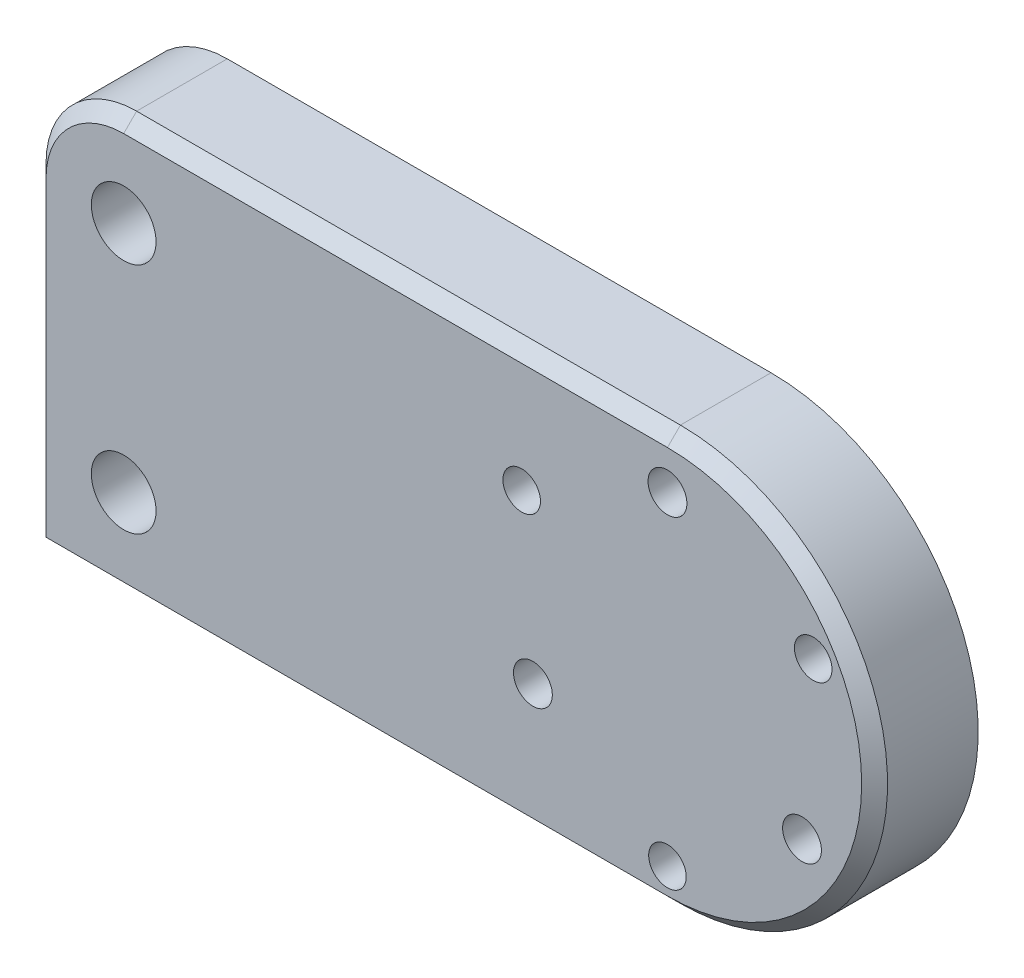
ISO-10303-21;
HEADER;
FILE_DESCRIPTION(('STEP AP214'),'2;1');
FILE_NAME('part.step','',(''),(''),'','','');
FILE_SCHEMA(('AUTOMOTIVE_DESIGN { 1 0 10303 214 1 1 1 1 }'));
ENDSEC;
DATA;
#1=APPLICATION_CONTEXT('core data for automotive mechanical design processes');
#2=APPLICATION_PROTOCOL_DEFINITION('international standard','automotive_design',2000,#1);
#3=PRODUCT_CONTEXT('',#1,'mechanical');
#4=PRODUCT('Part','Part','',(#3));
#5=PRODUCT_RELATED_PRODUCT_CATEGORY('part','',(#4));
#6=PRODUCT_DEFINITION_FORMATION('','',#4);
#7=PRODUCT_DEFINITION_CONTEXT('part definition',#1,'design');
#8=PRODUCT_DEFINITION('design','',#6,#7);
#9=PRODUCT_DEFINITION_SHAPE('','',#8);
#10=(LENGTH_UNIT() NAMED_UNIT(*) SI_UNIT(.MILLI.,.METRE.));
#11=(NAMED_UNIT(*) PLANE_ANGLE_UNIT() SI_UNIT($,.RADIAN.));
#12=(NAMED_UNIT(*) SI_UNIT($,.STERADIAN.) SOLID_ANGLE_UNIT());
#13=UNCERTAINTY_MEASURE_WITH_UNIT(LENGTH_MEASURE(1.E-05),#10,'distance_accuracy_value','');
#14=(GEOMETRIC_REPRESENTATION_CONTEXT(3) GLOBAL_UNCERTAINTY_ASSIGNED_CONTEXT((#13)) GLOBAL_UNIT_ASSIGNED_CONTEXT((#10,
#11,#12)) REPRESENTATION_CONTEXT('',''));
#15=CARTESIAN_POINT('',(0.,0.,0.));
#16=DIRECTION('',(0.,0.,1.));
#17=DIRECTION('',(1.,0.,0.));
#18=AXIS2_PLACEMENT_3D('',#15,#16,#17);
#19=CARTESIAN_POINT('',(0.,0.,8.));
#20=DIRECTION('',(0.,0.,-1.));
#21=DIRECTION('',(-1.,0.,0.));
#22=AXIS2_PLACEMENT_3D('',#19,#20,#21);
#23=PLANE('',#22);
#24=DIRECTION('',(0.,-1.,0.));
#25=VECTOR('',#24,1.);
#26=CARTESIAN_POINT('',(-48.,0.,8.));
#27=LINE('',#26,#25);
#28=CARTESIAN_POINT('',(-48.,8.99999999999999,8.));
#29=VERTEX_POINT('',#28);
#30=CARTESIAN_POINT('',(-48.,-15.,8.));
#31=VERTEX_POINT('',#30);
#32=EDGE_CURVE('E161',#29,#31,#27,.T.);
#33=ORIENTED_EDGE('',*,*,#32,.T.);
#34=DIRECTION('',(1.,0.,0.));
#35=VECTOR('',#34,1.);
#36=CARTESIAN_POINT('',(0.,-15.,8.));
#37=LINE('',#36,#35);
#38=CARTESIAN_POINT('',(0.,-15.,8.));
#39=VERTEX_POINT('',#38);
#40=EDGE_CURVE('E163',#31,#39,#37,.T.);
#41=ORIENTED_EDGE('',*,*,#40,.T.);
#42=CARTESIAN_POINT('',(0.,0.,8.));
#43=DIRECTION('',(0.,0.,-1.));
#44=DIRECTION('',(-1.,0.,0.));
#45=AXIS2_PLACEMENT_3D('',#42,#43,#44);
#46=CIRCLE('',#45,15.);
#47=CARTESIAN_POINT('',(0.,15.,8.));
#48=VERTEX_POINT('',#47);
#49=EDGE_CURVE('E159',#39,#48,#46,.F.);
#50=ORIENTED_EDGE('',*,*,#49,.T.);
#51=DIRECTION('',(-1.,0.,0.));
#52=VECTOR('',#51,1.);
#53=CARTESIAN_POINT('',(0.,15.,8.));
#54=LINE('',#53,#52);
#55=CARTESIAN_POINT('',(-42.,15.,8.));
#56=VERTEX_POINT('',#55);
#57=EDGE_CURVE('E155',#48,#56,#54,.T.);
#58=ORIENTED_EDGE('',*,*,#57,.T.);
#59=CARTESIAN_POINT('',(-42.,8.99999999999999,8.));
#60=DIRECTION('',(0.,0.,-1.));
#61=DIRECTION('',(-1.,0.,0.));
#62=AXIS2_PLACEMENT_3D('',#59,#60,#61);
#63=CIRCLE('',#62,6.);
#64=EDGE_CURVE('E157',#56,#29,#63,.F.);
#65=ORIENTED_EDGE('',*,*,#64,.T.);
#66=EDGE_LOOP('',(#33,#41,#50,#58,#65));
#67=FACE_BOUND('',#66,.T.);
#68=CARTESIAN_POINT('',(0.,-13.,8.));
#69=DIRECTION('',(0.,0.,1.));
#70=DIRECTION('',(1.,0.,0.));
#71=AXIS2_PLACEMENT_3D('',#68,#69,#70);
#72=CIRCLE('',#71,1.45);
#73=CARTESIAN_POINT('',(1.45,-13.,8.));
#74=VERTEX_POINT('',#73);
#75=EDGE_CURVE('E132',#74,#74,#72,.T.);
#76=ORIENTED_EDGE('',*,*,#75,.F.);
#77=EDGE_LOOP('',(#76));
#78=FACE_BOUND('',#77,.T.);
#79=CARTESIAN_POINT('',(10.3923048454132,-6.00000000000005,8.));
#80=DIRECTION('',(0.,0.,1.));
#81=DIRECTION('',(1.,0.,0.));
#82=AXIS2_PLACEMENT_3D('',#79,#80,#81);
#83=CIRCLE('',#82,1.5);
#84=CARTESIAN_POINT('',(11.8923048454132,-6.00000000000005,8.));
#85=VERTEX_POINT('',#84);
#86=EDGE_CURVE('E235',#85,#85,#83,.T.);
#87=ORIENTED_EDGE('',*,*,#86,.F.);
#88=EDGE_LOOP('',(#87));
#89=FACE_BOUND('',#88,.T.);
#90=CARTESIAN_POINT('',(11.2583302491978,6.4999999999999,8.));
#91=DIRECTION('',(0.,0.,1.));
#92=DIRECTION('',(1.,0.,0.));
#93=AXIS2_PLACEMENT_3D('',#90,#91,#92);
#94=CIRCLE('',#93,1.45);
#95=CARTESIAN_POINT('',(12.7083302491978,6.4999999999999,8.));
#96=VERTEX_POINT('',#95);
#97=EDGE_CURVE('E229',#96,#96,#94,.T.);
#98=ORIENTED_EDGE('',*,*,#97,.F.);
#99=EDGE_LOOP('',(#98));
#100=FACE_BOUND('',#99,.T.);
#101=CARTESIAN_POINT('',(-10.3923048454133,-5.9999999999999,8.));
#102=DIRECTION('',(0.,0.,1.));
#103=DIRECTION('',(1.,0.,0.));
#104=AXIS2_PLACEMENT_3D('',#101,#102,#103);
#105=CIRCLE('',#104,1.5);
#106=CARTESIAN_POINT('',(-8.89230484541332,-5.9999999999999,8.));
#107=VERTEX_POINT('',#106);
#108=EDGE_CURVE('E223',#107,#107,#105,.T.);
#109=ORIENTED_EDGE('',*,*,#108,.F.);
#110=EDGE_LOOP('',(#109));
#111=FACE_BOUND('',#110,.T.);
#112=CARTESIAN_POINT('',(-11.2583302491977,6.50000000000005,8.));
#113=DIRECTION('',(0.,0.,1.));
#114=DIRECTION('',(1.,0.,0.));
#115=AXIS2_PLACEMENT_3D('',#112,#113,#114);
#116=CIRCLE('',#115,1.45);
#117=CARTESIAN_POINT('',(-9.80833024919767,6.50000000000005,8.));
#118=VERTEX_POINT('',#117);
#119=EDGE_CURVE('E217',#118,#118,#116,.T.);
#120=ORIENTED_EDGE('',*,*,#119,.F.);
#121=EDGE_LOOP('',(#120));
#122=FACE_BOUND('',#121,.T.);
#123=CARTESIAN_POINT('',(0.,12.,8.));
#124=DIRECTION('',(0.,0.,1.));
#125=DIRECTION('',(1.,0.,0.));
#126=AXIS2_PLACEMENT_3D('',#123,#124,#125);
#127=CIRCLE('',#126,1.5);
#128=CARTESIAN_POINT('',(1.5,12.,8.));
#129=VERTEX_POINT('',#128);
#130=EDGE_CURVE('E211',#129,#129,#127,.T.);
#131=ORIENTED_EDGE('',*,*,#130,.F.);
#132=EDGE_LOOP('',(#131));
#133=FACE_BOUND('',#132,.T.);
#134=CARTESIAN_POINT('',(-42.,9.,8.));
#135=DIRECTION('',(0.,0.,1.));
#136=DIRECTION('',(1.,0.,0.));
#137=AXIS2_PLACEMENT_3D('',#134,#135,#136);
#138=CIRCLE('',#137,2.49999999999999);
#139=CARTESIAN_POINT('',(-39.5,9.,8.));
#140=VERTEX_POINT('',#139);
#141=EDGE_CURVE('E205',#140,#140,#138,.T.);
#142=ORIENTED_EDGE('',*,*,#141,.F.);
#143=EDGE_LOOP('',(#142));
#144=FACE_BOUND('',#143,.T.);
#145=CARTESIAN_POINT('',(-42.,-9.,8.));
#146=DIRECTION('',(0.,0.,1.));
#147=DIRECTION('',(1.,0.,0.));
#148=AXIS2_PLACEMENT_3D('',#145,#146,#147);
#149=CIRCLE('',#148,2.49999999999999);
#150=CARTESIAN_POINT('',(-39.5,-9.,8.));
#151=VERTEX_POINT('',#150);
#152=EDGE_CURVE('E197',#151,#151,#149,.T.);
#153=ORIENTED_EDGE('',*,*,#152,.F.);
#154=EDGE_LOOP('',(#153));
#155=FACE_BOUND('',#154,.T.);
#156=ADVANCED_FACE('F37',(#67,#78,#89,#100,#111,#122,#133,#144,#155),#23,.F.);
#157=CARTESIAN_POINT('',(0.,0.,0.));
#158=DIRECTION('',(0.,0.,-1.));
#159=DIRECTION('',(-1.,0.,0.));
#160=AXIS2_PLACEMENT_3D('',#157,#158,#159);
#161=PLANE('',#160);
#162=CARTESIAN_POINT('',(-42.,9.,0.));
#163=DIRECTION('',(0.,0.,1.));
#164=DIRECTION('',(1.,0.,0.));
#165=AXIS2_PLACEMENT_3D('',#162,#163,#164);
#166=CIRCLE('',#165,2.49999999999999);
#167=CARTESIAN_POINT('',(-39.5,9.,0.));
#168=VERTEX_POINT('',#167);
#169=EDGE_CURVE('E202',#168,#168,#166,.T.);
#170=ORIENTED_EDGE('',*,*,#169,.T.);
#171=EDGE_LOOP('',(#170));
#172=FACE_BOUND('',#171,.T.);
#173=CARTESIAN_POINT('',(-11.2583302491977,6.50000000000005,0.));
#174=DIRECTION('',(0.,0.,1.));
#175=DIRECTION('',(1.,0.,0.));
#176=AXIS2_PLACEMENT_3D('',#173,#174,#175);
#177=CIRCLE('',#176,1.45);
#178=CARTESIAN_POINT('',(-9.80833024919767,6.50000000000005,0.));
#179=VERTEX_POINT('',#178);
#180=EDGE_CURVE('E214',#179,#179,#177,.T.);
#181=ORIENTED_EDGE('',*,*,#180,.T.);
#182=EDGE_LOOP('',(#181));
#183=FACE_BOUND('',#182,.T.);
#184=CARTESIAN_POINT('',(11.2583302491978,6.4999999999999,0.));
#185=DIRECTION('',(0.,0.,1.));
#186=DIRECTION('',(1.,0.,0.));
#187=AXIS2_PLACEMENT_3D('',#184,#185,#186);
#188=CIRCLE('',#187,1.45);
#189=CARTESIAN_POINT('',(12.7083302491978,6.4999999999999,0.));
#190=VERTEX_POINT('',#189);
#191=EDGE_CURVE('E226',#190,#190,#188,.T.);
#192=ORIENTED_EDGE('',*,*,#191,.T.);
#193=EDGE_LOOP('',(#192));
#194=FACE_BOUND('',#193,.T.);
#195=CARTESIAN_POINT('',(0.,-13.,0.));
#196=DIRECTION('',(0.,0.,1.));
#197=DIRECTION('',(1.,0.,0.));
#198=AXIS2_PLACEMENT_3D('',#195,#196,#197);
#199=CIRCLE('',#198,1.45);
#200=CARTESIAN_POINT('',(1.45,-13.,0.));
#201=VERTEX_POINT('',#200);
#202=EDGE_CURVE('E135',#201,#201,#199,.T.);
#203=ORIENTED_EDGE('',*,*,#202,.T.);
#204=EDGE_LOOP('',(#203));
#205=FACE_BOUND('',#204,.T.);
#206=DIRECTION('',(1.,0.,0.));
#207=VECTOR('',#206,1.);
#208=CARTESIAN_POINT('',(0.,-16.,0.));
#209=LINE('',#208,#207);
#210=CARTESIAN_POINT('',(-48.,-16.,0.));
#211=VERTEX_POINT('',#210);
#212=CARTESIAN_POINT('',(0.,-16.,0.));
#213=VERTEX_POINT('',#212);
#214=EDGE_CURVE('E143',#211,#213,#209,.T.);
#215=ORIENTED_EDGE('',*,*,#214,.F.);
#216=DIRECTION('',(0.70710678118655,-0.707106781186545,0.));
#217=VECTOR('',#216,1.);
#218=CARTESIAN_POINT('',(-31.9999999999998,-32.0000000000001,0.));
#219=LINE('',#218,#217);
#220=CARTESIAN_POINT('',(-49.,-15.,0.));
#221=VERTEX_POINT('',#220);
#222=EDGE_CURVE('E150',#211,#221,#219,.F.);
#223=ORIENTED_EDGE('',*,*,#222,.T.);
#224=DIRECTION('',(0.,-1.,0.));
#225=VECTOR('',#224,1.);
#226=CARTESIAN_POINT('',(-49.,8.99999999999999,0.));
#227=LINE('',#226,#225);
#228=CARTESIAN_POINT('',(-49.,8.99999999999999,0.));
#229=VERTEX_POINT('',#228);
#230=EDGE_CURVE('E140',#229,#221,#227,.T.);
#231=ORIENTED_EDGE('',*,*,#230,.F.);
#232=CARTESIAN_POINT('',(-42.,8.99999999999999,0.));
#233=DIRECTION('',(0.,0.,1.));
#234=DIRECTION('',(1.,0.,0.));
#235=AXIS2_PLACEMENT_3D('',#232,#233,#234);
#236=CIRCLE('',#235,7.);
#237=CARTESIAN_POINT('',(-42.,16.,0.));
#238=VERTEX_POINT('',#237);
#239=EDGE_CURVE('E126',#238,#229,#236,.T.);
#240=ORIENTED_EDGE('',*,*,#239,.F.);
#241=DIRECTION('',(-1.,0.,0.));
#242=VECTOR('',#241,1.);
#243=CARTESIAN_POINT('',(0.,16.,0.));
#244=LINE('',#243,#242);
#245=CARTESIAN_POINT('',(0.,16.,0.));
#246=VERTEX_POINT('',#245);
#247=EDGE_CURVE('E110',#246,#238,#244,.T.);
#248=ORIENTED_EDGE('',*,*,#247,.F.);
#249=CARTESIAN_POINT('',(0.,0.,0.));
#250=DIRECTION('',(0.,0.,1.));
#251=DIRECTION('',(-1.,0.,0.));
#252=AXIS2_PLACEMENT_3D('',#249,#250,#251);
#253=CIRCLE('',#252,16.);
#254=EDGE_CURVE('E123',#213,#246,#253,.T.);
#255=ORIENTED_EDGE('',*,*,#254,.F.);
#256=EDGE_LOOP('',(#215,#223,#231,#240,#248,#255));
#257=FACE_BOUND('',#256,.T.);
#258=CARTESIAN_POINT('',(10.3923048454132,-6.00000000000005,0.));
#259=DIRECTION('',(0.,0.,1.));
#260=DIRECTION('',(1.,0.,0.));
#261=AXIS2_PLACEMENT_3D('',#258,#259,#260);
#262=CIRCLE('',#261,1.5);
#263=CARTESIAN_POINT('',(11.8923048454132,-6.00000000000005,0.));
#264=VERTEX_POINT('',#263);
#265=EDGE_CURVE('E232',#264,#264,#262,.T.);
#266=ORIENTED_EDGE('',*,*,#265,.T.);
#267=EDGE_LOOP('',(#266));
#268=FACE_BOUND('',#267,.T.);
#269=CARTESIAN_POINT('',(-10.3923048454133,-5.9999999999999,0.));
#270=DIRECTION('',(0.,0.,1.));
#271=DIRECTION('',(1.,0.,0.));
#272=AXIS2_PLACEMENT_3D('',#269,#270,#271);
#273=CIRCLE('',#272,1.5);
#274=CARTESIAN_POINT('',(-8.89230484541332,-5.9999999999999,0.));
#275=VERTEX_POINT('',#274);
#276=EDGE_CURVE('E220',#275,#275,#273,.T.);
#277=ORIENTED_EDGE('',*,*,#276,.T.);
#278=EDGE_LOOP('',(#277));
#279=FACE_BOUND('',#278,.T.);
#280=CARTESIAN_POINT('',(0.,12.,0.));
#281=DIRECTION('',(0.,0.,1.));
#282=DIRECTION('',(1.,0.,0.));
#283=AXIS2_PLACEMENT_3D('',#280,#281,#282);
#284=CIRCLE('',#283,1.5);
#285=CARTESIAN_POINT('',(1.5,12.,0.));
#286=VERTEX_POINT('',#285);
#287=EDGE_CURVE('E208',#286,#286,#284,.T.);
#288=ORIENTED_EDGE('',*,*,#287,.T.);
#289=EDGE_LOOP('',(#288));
#290=FACE_BOUND('',#289,.T.);
#291=CARTESIAN_POINT('',(-42.,-9.,0.));
#292=DIRECTION('',(0.,0.,1.));
#293=DIRECTION('',(1.,0.,0.));
#294=AXIS2_PLACEMENT_3D('',#291,#292,#293);
#295=CIRCLE('',#294,2.49999999999999);
#296=CARTESIAN_POINT('',(-39.5,-9.,0.));
#297=VERTEX_POINT('',#296);
#298=EDGE_CURVE('E192',#297,#297,#295,.T.);
#299=ORIENTED_EDGE('',*,*,#298,.T.);
#300=EDGE_LOOP('',(#299));
#301=FACE_BOUND('',#300,.T.);
#302=ADVANCED_FACE('F121',(#172,#183,#194,#205,#257,#268,#279,#290,#301),#161,.T.);
#303=CARTESIAN_POINT('',(0.,0.,8.));
#304=DIRECTION('',(0.,0.,-1.));
#305=DIRECTION('',(-1.,0.,0.));
#306=AXIS2_PLACEMENT_3D('',#303,#304,#305);
#307=CYLINDRICAL_SURFACE('',#306,16.);
#308=DIRECTION('',(0.,0.,-1.));
#309=VECTOR('',#308,1.);
#310=CARTESIAN_POINT('',(0.,16.,8.));
#311=LINE('',#310,#309);
#312=CARTESIAN_POINT('',(0.,16.,6.99999999999999));
#313=VERTEX_POINT('',#312);
#314=EDGE_CURVE('E107',#313,#246,#311,.T.);
#315=ORIENTED_EDGE('',*,*,#314,.F.);
#316=CARTESIAN_POINT('',(0.,0.,6.99999999999999));
#317=DIRECTION('',(0.,0.,-1.));
#318=DIRECTION('',(-1.,0.,0.));
#319=AXIS2_PLACEMENT_3D('',#316,#317,#318);
#320=CIRCLE('',#319,16.);
#321=CARTESIAN_POINT('',(0.,-16.,6.99999999999999));
#322=VERTEX_POINT('',#321);
#323=EDGE_CURVE('E175',#313,#322,#320,.T.);
#324=ORIENTED_EDGE('',*,*,#323,.T.);
#325=DIRECTION('',(0.,0.,-1.));
#326=VECTOR('',#325,1.);
#327=CARTESIAN_POINT('',(0.,-16.,8.));
#328=LINE('',#327,#326);
#329=EDGE_CURVE('E130',#322,#213,#328,.T.);
#330=ORIENTED_EDGE('',*,*,#329,.T.);
#331=ORIENTED_EDGE('',*,*,#254,.T.);
#332=EDGE_LOOP('',(#315,#324,#330,#331));
#333=FACE_BOUND('',#332,.T.);
#334=ADVANCED_FACE('F128',(#333),#307,.T.);
#335=CARTESIAN_POINT('',(0.,16.,8.));
#336=DIRECTION('',(0.,-1.,0.));
#337=DIRECTION('',(1.,0.,0.));
#338=AXIS2_PLACEMENT_3D('',#335,#336,#337);
#339=PLANE('',#338);
#340=DIRECTION('',(0.,0.,-1.));
#341=VECTOR('',#340,1.);
#342=CARTESIAN_POINT('',(-42.,16.,8.));
#343=LINE('',#342,#341);
#344=CARTESIAN_POINT('',(-42.,16.,6.99999999999999));
#345=VERTEX_POINT('',#344);
#346=EDGE_CURVE('E116',#345,#238,#343,.T.);
#347=ORIENTED_EDGE('',*,*,#346,.F.);
#348=DIRECTION('',(1.,0.,0.));
#349=VECTOR('',#348,1.);
#350=CARTESIAN_POINT('',(0.,16.,6.99999999999999));
#351=LINE('',#350,#349);
#352=EDGE_CURVE('E11',#345,#313,#351,.T.);
#353=ORIENTED_EDGE('',*,*,#352,.T.);
#354=ORIENTED_EDGE('',*,*,#314,.T.);
#355=ORIENTED_EDGE('',*,*,#247,.T.);
#356=EDGE_LOOP('',(#347,#353,#354,#355));
#357=FACE_BOUND('',#356,.T.);
#358=ADVANCED_FACE('F109',(#357),#339,.F.);
#359=CARTESIAN_POINT('',(-42.,8.99999999999999,8.));
#360=DIRECTION('',(0.,0.,-1.));
#361=DIRECTION('',(-1.,0.,0.));
#362=AXIS2_PLACEMENT_3D('',#359,#360,#361);
#363=CYLINDRICAL_SURFACE('',#362,7.);
#364=DIRECTION('',(0.,0.,-1.));
#365=VECTOR('',#364,1.);
#366=CARTESIAN_POINT('',(-49.,8.99999999999999,8.));
#367=LINE('',#366,#365);
#368=CARTESIAN_POINT('',(-49.,8.99999999999999,6.99999999999999));
#369=VERTEX_POINT('',#368);
#370=EDGE_CURVE('E146',#369,#229,#367,.T.);
#371=ORIENTED_EDGE('',*,*,#370,.F.);
#372=CARTESIAN_POINT('',(-42.,8.99999999999999,6.99999999999999));
#373=DIRECTION('',(0.,0.,-1.));
#374=DIRECTION('',(-1.,0.,0.));
#375=AXIS2_PLACEMENT_3D('',#372,#373,#374);
#376=CIRCLE('',#375,7.);
#377=EDGE_CURVE('E47',#369,#345,#376,.T.);
#378=ORIENTED_EDGE('',*,*,#377,.T.);
#379=ORIENTED_EDGE('',*,*,#346,.T.);
#380=ORIENTED_EDGE('',*,*,#239,.T.);
#381=EDGE_LOOP('',(#371,#378,#379,#380));
#382=FACE_BOUND('',#381,.T.);
#383=ADVANCED_FACE('F274',(#382),#363,.T.);
#384=CARTESIAN_POINT('',(-49.,8.99999999999999,8.));
#385=DIRECTION('',(1.,0.,0.));
#386=DIRECTION('',(0.,1.,0.));
#387=AXIS2_PLACEMENT_3D('',#384,#385,#386);
#388=PLANE('',#387);
#389=DIRECTION('',(0.,0.,1.));
#390=VECTOR('',#389,1.);
#391=CARTESIAN_POINT('',(-49.,-15.,8.));
#392=LINE('',#391,#390);
#393=CARTESIAN_POINT('',(-49.,-15.,6.99999999999999));
#394=VERTEX_POINT('',#393);
#395=EDGE_CURVE('E152',#221,#394,#392,.T.);
#396=ORIENTED_EDGE('',*,*,#395,.T.);
#397=DIRECTION('',(0.,1.,0.));
#398=VECTOR('',#397,1.);
#399=CARTESIAN_POINT('',(-49.,8.99999999999999,6.99999999999999));
#400=LINE('',#399,#398);
#401=EDGE_CURVE('E173',#394,#369,#400,.T.);
#402=ORIENTED_EDGE('',*,*,#401,.T.);
#403=ORIENTED_EDGE('',*,*,#370,.T.);
#404=ORIENTED_EDGE('',*,*,#230,.T.);
#405=EDGE_LOOP('',(#396,#402,#403,#404));
#406=FACE_BOUND('',#405,.T.);
#407=ADVANCED_FACE('F270',(#406),#388,.F.);
#408=CARTESIAN_POINT('',(0.,-16.,8.));
#409=DIRECTION('',(0.,1.,0.));
#410=DIRECTION('',(0.,0.,1.));
#411=AXIS2_PLACEMENT_3D('',#408,#409,#410);
#412=PLANE('',#411);
#413=ORIENTED_EDGE('',*,*,#329,.F.);
#414=DIRECTION('',(-1.,0.,0.));
#415=VECTOR('',#414,1.);
#416=CARTESIAN_POINT('',(0.,-16.,6.99999999999999));
#417=LINE('',#416,#415);
#418=CARTESIAN_POINT('',(-48.,-16.,6.99999999999999));
#419=VERTEX_POINT('',#418);
#420=EDGE_CURVE('E166',#322,#419,#417,.T.);
#421=ORIENTED_EDGE('',*,*,#420,.T.);
#422=DIRECTION('',(0.,0.,-1.));
#423=VECTOR('',#422,1.);
#424=CARTESIAN_POINT('',(-48.,-16.,8.));
#425=LINE('',#424,#423);
#426=EDGE_CURVE('E115',#419,#211,#425,.T.);
#427=ORIENTED_EDGE('',*,*,#426,.T.);
#428=ORIENTED_EDGE('',*,*,#214,.T.);
#429=EDGE_LOOP('',(#413,#421,#427,#428));
#430=FACE_BOUND('',#429,.T.);
#431=ADVANCED_FACE('F255',(#430),#412,.F.);
#432=CARTESIAN_POINT('',(0.,-13.,8.));
#433=DIRECTION('',(0.,0.,-1.));
#434=DIRECTION('',(-1.,0.,0.));
#435=AXIS2_PLACEMENT_3D('',#432,#433,#434);
#436=CYLINDRICAL_SURFACE('',#435,1.45);
#437=ORIENTED_EDGE('',*,*,#75,.T.);
#438=EDGE_LOOP('',(#437));
#439=FACE_BOUND('',#438,.T.);
#440=ORIENTED_EDGE('',*,*,#202,.F.);
#441=EDGE_LOOP('',(#440));
#442=FACE_BOUND('',#441,.T.);
#443=ADVANCED_FACE('F245',(#439,#442),#436,.F.);
#444=CARTESIAN_POINT('',(10.3923048454132,-6.00000000000005,8.));
#445=DIRECTION('',(0.,0.,-1.));
#446=DIRECTION('',(-1.,0.,0.));
#447=AXIS2_PLACEMENT_3D('',#444,#445,#446);
#448=CYLINDRICAL_SURFACE('',#447,1.5);
#449=ORIENTED_EDGE('',*,*,#86,.T.);
#450=EDGE_LOOP('',(#449));
#451=FACE_BOUND('',#450,.T.);
#452=ORIENTED_EDGE('',*,*,#265,.F.);
#453=EDGE_LOOP('',(#452));
#454=FACE_BOUND('',#453,.T.);
#455=ADVANCED_FACE('F242',(#451,#454),#448,.F.);
#456=CARTESIAN_POINT('',(11.2583302491978,6.4999999999999,8.));
#457=DIRECTION('',(0.,0.,-1.));
#458=DIRECTION('',(-1.,0.,0.));
#459=AXIS2_PLACEMENT_3D('',#456,#457,#458);
#460=CYLINDRICAL_SURFACE('',#459,1.45);
#461=ORIENTED_EDGE('',*,*,#97,.T.);
#462=EDGE_LOOP('',(#461));
#463=FACE_BOUND('',#462,.T.);
#464=ORIENTED_EDGE('',*,*,#191,.F.);
#465=EDGE_LOOP('',(#464));
#466=FACE_BOUND('',#465,.T.);
#467=ADVANCED_FACE('F244',(#463,#466),#460,.F.);
#468=CARTESIAN_POINT('',(-10.3923048454133,-5.9999999999999,8.));
#469=DIRECTION('',(0.,0.,-1.));
#470=DIRECTION('',(-1.,0.,0.));
#471=AXIS2_PLACEMENT_3D('',#468,#469,#470);
#472=CYLINDRICAL_SURFACE('',#471,1.5);
#473=ORIENTED_EDGE('',*,*,#108,.T.);
#474=EDGE_LOOP('',(#473));
#475=FACE_BOUND('',#474,.T.);
#476=ORIENTED_EDGE('',*,*,#276,.F.);
#477=EDGE_LOOP('',(#476));
#478=FACE_BOUND('',#477,.T.);
#479=ADVANCED_FACE('F252',(#475,#478),#472,.F.);
#480=CARTESIAN_POINT('',(-11.2583302491977,6.50000000000005,8.));
#481=DIRECTION('',(0.,0.,-1.));
#482=DIRECTION('',(-1.,0.,0.));
#483=AXIS2_PLACEMENT_3D('',#480,#481,#482);
#484=CYLINDRICAL_SURFACE('',#483,1.45);
#485=ORIENTED_EDGE('',*,*,#119,.T.);
#486=EDGE_LOOP('',(#485));
#487=FACE_BOUND('',#486,.T.);
#488=ORIENTED_EDGE('',*,*,#180,.F.);
#489=EDGE_LOOP('',(#488));
#490=FACE_BOUND('',#489,.T.);
#491=ADVANCED_FACE('F359',(#487,#490),#484,.F.);
#492=CARTESIAN_POINT('',(0.,12.,8.));
#493=DIRECTION('',(0.,0.,-1.));
#494=DIRECTION('',(-1.,0.,0.));
#495=AXIS2_PLACEMENT_3D('',#492,#493,#494);
#496=CYLINDRICAL_SURFACE('',#495,1.5);
#497=ORIENTED_EDGE('',*,*,#130,.T.);
#498=EDGE_LOOP('',(#497));
#499=FACE_BOUND('',#498,.T.);
#500=ORIENTED_EDGE('',*,*,#287,.F.);
#501=EDGE_LOOP('',(#500));
#502=FACE_BOUND('',#501,.T.);
#503=ADVANCED_FACE('F351',(#499,#502),#496,.F.);
#504=CARTESIAN_POINT('',(-42.,9.,8.));
#505=DIRECTION('',(0.,0.,-1.));
#506=DIRECTION('',(-1.,0.,0.));
#507=AXIS2_PLACEMENT_3D('',#504,#505,#506);
#508=CYLINDRICAL_SURFACE('',#507,2.49999999999999);
#509=ORIENTED_EDGE('',*,*,#141,.T.);
#510=EDGE_LOOP('',(#509));
#511=FACE_BOUND('',#510,.T.);
#512=ORIENTED_EDGE('',*,*,#169,.F.);
#513=EDGE_LOOP('',(#512));
#514=FACE_BOUND('',#513,.T.);
#515=ADVANCED_FACE('F342',(#511,#514),#508,.F.);
#516=CARTESIAN_POINT('',(-42.,-9.,8.));
#517=DIRECTION('',(0.,0.,-1.));
#518=DIRECTION('',(-1.,0.,0.));
#519=AXIS2_PLACEMENT_3D('',#516,#517,#518);
#520=CYLINDRICAL_SURFACE('',#519,2.49999999999999);
#521=ORIENTED_EDGE('',*,*,#152,.T.);
#522=EDGE_LOOP('',(#521));
#523=FACE_BOUND('',#522,.T.);
#524=ORIENTED_EDGE('',*,*,#298,.F.);
#525=EDGE_LOOP('',(#524));
#526=FACE_BOUND('',#525,.T.);
#527=ADVANCED_FACE('F288',(#523,#526),#520,.F.);
#528=CARTESIAN_POINT('',(-48.,-16.,8.));
#529=DIRECTION('',(0.707106781186545,0.70710678118655,0.));
#530=DIRECTION('',(0.,0.,-1.));
#531=AXIS2_PLACEMENT_3D('',#528,#529,#530);
#532=PLANE('',#531);
#533=ORIENTED_EDGE('',*,*,#426,.F.);
#534=DIRECTION('',(-0.577350269189628,0.577350269189625,0.577350269189625));
#535=VECTOR('',#534,1.);
#536=CARTESIAN_POINT('',(-48.3333333333333,-15.6666666666667,7.33333333333333));
#537=LINE('',#536,#535);
#538=CARTESIAN_POINT('',(-48.5,-15.5,7.49999999999999));
#539=VERTEX_POINT('',#538);
#540=EDGE_CURVE('E171',#419,#539,#537,.T.);
#541=ORIENTED_EDGE('',*,*,#540,.T.);
#542=DIRECTION('',(-0.577350269189627,0.577350269189623,-0.577350269189628));
#543=VECTOR('',#542,1.);
#544=CARTESIAN_POINT('',(-48.,-16.,8.));
#545=LINE('',#544,#543);
#546=EDGE_CURVE('E169',#539,#394,#545,.T.);
#547=ORIENTED_EDGE('',*,*,#546,.T.);
#548=ORIENTED_EDGE('',*,*,#395,.F.);
#549=ORIENTED_EDGE('',*,*,#222,.F.);
#550=EDGE_LOOP('',(#533,#541,#547,#548,#549));
#551=FACE_BOUND('',#550,.T.);
#552=ADVANCED_FACE('F283',(#551),#532,.F.);
#553=CARTESIAN_POINT('',(-42.,8.99999999999999,8.));
#554=DIRECTION('',(0.,0.,-1.));
#555=DIRECTION('',(-1.,0.,0.));
#556=AXIS2_PLACEMENT_3D('',#553,#554,#555);
#557=CONICAL_SURFACE('',#556,6.,0.785398163397448);
#558=DIRECTION('',(-0.707106781186547,0.,-0.707106781186547));
#559=VECTOR('',#558,1.);
#560=CARTESIAN_POINT('',(-48.,8.99999999999999,8.));
#561=LINE('',#560,#559);
#562=EDGE_CURVE('E185',#29,#369,#561,.T.);
#563=ORIENTED_EDGE('',*,*,#562,.F.);
#564=ORIENTED_EDGE('',*,*,#64,.F.);
#565=DIRECTION('',(0.,-0.707106781186546,0.707106781186549));
#566=VECTOR('',#565,1.);
#567=CARTESIAN_POINT('',(-42.,16.,6.99999999999999));
#568=LINE('',#567,#566);
#569=EDGE_CURVE('E42',#345,#56,#568,.T.);
#570=ORIENTED_EDGE('',*,*,#569,.F.);
#571=ORIENTED_EDGE('',*,*,#377,.F.);
#572=EDGE_LOOP('',(#563,#564,#570,#571));
#573=FACE_BOUND('',#572,.T.);
#574=ADVANCED_FACE('F40',(#573),#557,.T.);
#575=CARTESIAN_POINT('',(0.,15.,8.));
#576=DIRECTION('',(0.,-0.707106781186547,-0.707106781186547));
#577=DIRECTION('',(-1.,0.,0.));
#578=AXIS2_PLACEMENT_3D('',#575,#576,#577);
#579=PLANE('',#578);
#580=ORIENTED_EDGE('',*,*,#569,.T.);
#581=ORIENTED_EDGE('',*,*,#57,.F.);
#582=DIRECTION('',(0.,-0.707106781186547,0.707106781186547));
#583=VECTOR('',#582,1.);
#584=CARTESIAN_POINT('',(0.,16.,6.99999999999999));
#585=LINE('',#584,#583);
#586=EDGE_CURVE('E183',#313,#48,#585,.T.);
#587=ORIENTED_EDGE('',*,*,#586,.F.);
#588=ORIENTED_EDGE('',*,*,#352,.F.);
#589=EDGE_LOOP('',(#580,#581,#587,#588));
#590=FACE_BOUND('',#589,.T.);
#591=ADVANCED_FACE('F310',(#590),#579,.F.);
#592=CARTESIAN_POINT('',(-48.,0.,8.));
#593=DIRECTION('',(0.707106781186548,0.,-0.707106781186547));
#594=DIRECTION('',(0.,-1.,0.));
#595=AXIS2_PLACEMENT_3D('',#592,#593,#594);
#596=PLANE('',#595);
#597=ORIENTED_EDGE('',*,*,#401,.F.);
#598=ORIENTED_EDGE('',*,*,#546,.F.);
#599=DIRECTION('',(-0.577350269189625,-0.577350269189626,-0.577350269189626));
#600=VECTOR('',#599,1.);
#601=CARTESIAN_POINT('',(-32.0000000000001,1.,24.));
#602=LINE('',#601,#600);
#603=EDGE_CURVE('E180',#31,#539,#602,.T.);
#604=ORIENTED_EDGE('',*,*,#603,.F.);
#605=ORIENTED_EDGE('',*,*,#32,.F.);
#606=ORIENTED_EDGE('',*,*,#562,.T.);
#607=EDGE_LOOP('',(#597,#598,#604,#605,#606));
#608=FACE_BOUND('',#607,.T.);
#609=ADVANCED_FACE('F304',(#608),#596,.F.);
#610=CARTESIAN_POINT('',(0.,0.,8.));
#611=DIRECTION('',(0.,0.,-1.));
#612=DIRECTION('',(-1.,0.,0.));
#613=AXIS2_PLACEMENT_3D('',#610,#611,#612);
#614=CONICAL_SURFACE('',#613,15.,0.785398163397448);
#615=ORIENTED_EDGE('',*,*,#586,.T.);
#616=ORIENTED_EDGE('',*,*,#49,.F.);
#617=DIRECTION('',(0.,0.707106781186547,0.707106781186547));
#618=VECTOR('',#617,1.);
#619=CARTESIAN_POINT('',(0.,-16.,6.99999999999999));
#620=LINE('',#619,#618);
#621=EDGE_CURVE('E178',#322,#39,#620,.T.);
#622=ORIENTED_EDGE('',*,*,#621,.F.);
#623=ORIENTED_EDGE('',*,*,#323,.F.);
#624=EDGE_LOOP('',(#615,#616,#622,#623));
#625=FACE_BOUND('',#624,.T.);
#626=ADVANCED_FACE('F297',(#625),#614,.T.);
#627=CARTESIAN_POINT('',(0.,-15.,8.));
#628=DIRECTION('',(0.,0.707106781186547,-0.707106781186547));
#629=DIRECTION('',(1.,0.,0.));
#630=AXIS2_PLACEMENT_3D('',#627,#628,#629);
#631=PLANE('',#630);
#632=ORIENTED_EDGE('',*,*,#540,.F.);
#633=ORIENTED_EDGE('',*,*,#420,.F.);
#634=ORIENTED_EDGE('',*,*,#621,.T.);
#635=ORIENTED_EDGE('',*,*,#40,.F.);
#636=ORIENTED_EDGE('',*,*,#603,.T.);
#637=EDGE_LOOP('',(#632,#633,#634,#635,#636));
#638=FACE_BOUND('',#637,.T.);
#639=ADVANCED_FACE('F291',(#638),#631,.F.);
#640=CLOSED_SHELL('',(#156,#302,#334,#358,#383,#407,#431,#443,#455,#467,#479,#491,#503,#515,
#527,#552,#574,#591,#609,#626,#639));
#641=MANIFOLD_SOLID_BREP('B2',#640);
#642=ADVANCED_BREP_SHAPE_REPRESENTATION('',(#18,#641),#14);
#643=SHAPE_DEFINITION_REPRESENTATION(#9,#642);
ENDSEC;
END-ISO-10303-21;
